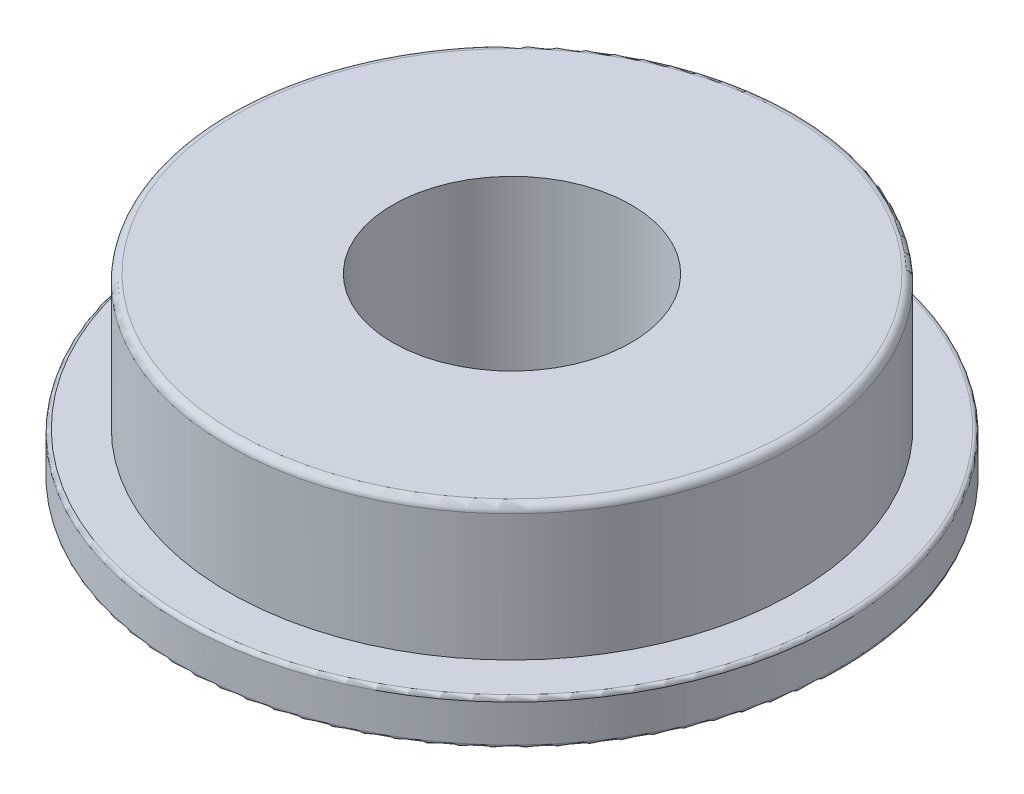
ISO-10303-21;
HEADER;
FILE_DESCRIPTION(('STEP AP214'),'2;1');
FILE_NAME('part.step','',(''),(''),'','','');
FILE_SCHEMA(('AUTOMOTIVE_DESIGN { 1 0 10303 214 1 1 1 1 }'));
ENDSEC;
DATA;
#1=APPLICATION_CONTEXT('core data for automotive mechanical design processes');
#2=APPLICATION_PROTOCOL_DEFINITION('international standard','automotive_design',2000,#1);
#3=PRODUCT_CONTEXT('',#1,'mechanical');
#4=PRODUCT('Part','Part','',(#3));
#5=PRODUCT_RELATED_PRODUCT_CATEGORY('part','',(#4));
#6=PRODUCT_DEFINITION_FORMATION('','',#4);
#7=PRODUCT_DEFINITION_CONTEXT('part definition',#1,'design');
#8=PRODUCT_DEFINITION('design','',#6,#7);
#9=PRODUCT_DEFINITION_SHAPE('','',#8);
#10=(LENGTH_UNIT() NAMED_UNIT(*) SI_UNIT(.MILLI.,.METRE.));
#11=(NAMED_UNIT(*) PLANE_ANGLE_UNIT() SI_UNIT($,.RADIAN.));
#12=(NAMED_UNIT(*) SI_UNIT($,.STERADIAN.) SOLID_ANGLE_UNIT());
#13=UNCERTAINTY_MEASURE_WITH_UNIT(LENGTH_MEASURE(1.E-05),#10,'distance_accuracy_value','');
#14=(GEOMETRIC_REPRESENTATION_CONTEXT(3) GLOBAL_UNCERTAINTY_ASSIGNED_CONTEXT((#13)) GLOBAL_UNIT_ASSIGNED_CONTEXT((#10,
#11,#12)) REPRESENTATION_CONTEXT('',''));
#15=CARTESIAN_POINT('',(0.,0.,0.));
#16=DIRECTION('',(0.,0.,1.));
#17=DIRECTION('',(1.,0.,0.));
#18=AXIS2_PLACEMENT_3D('',#15,#16,#17);
#19=CARTESIAN_POINT('',(0.,0.,0.));
#20=DIRECTION('',(0.,-1.,0.));
#21=DIRECTION('',(0.,0.,-1.));
#22=AXIS2_PLACEMENT_3D('',#19,#20,#21);
#23=CYLINDRICAL_SURFACE('',#22,9.5);
#24=CARTESIAN_POINT('',(0.,1.5,0.));
#25=DIRECTION('',(0.,-1.,0.));
#26=DIRECTION('',(0.,0.,-1.));
#27=AXIS2_PLACEMENT_3D('',#24,#25,#26);
#28=CIRCLE('',#27,9.5);
#29=CARTESIAN_POINT('',(0.,1.5,-9.5));
#30=VERTEX_POINT('',#29);
#31=EDGE_CURVE('E19',#30,#30,#28,.T.);
#32=ORIENTED_EDGE('',*,*,#31,.F.);
#33=EDGE_LOOP('',(#32));
#34=FACE_BOUND('',#33,.T.);
#35=CARTESIAN_POINT('',(0.,5.746,0.));
#36=DIRECTION('',(0.,1.,0.));
#37=DIRECTION('',(0.,0.,1.));
#38=AXIS2_PLACEMENT_3D('',#35,#36,#37);
#39=CIRCLE('',#38,9.5);
#40=CARTESIAN_POINT('',(0.,5.746,9.5));
#41=VERTEX_POINT('',#40);
#42=EDGE_CURVE('E42',#41,#41,#39,.T.);
#43=ORIENTED_EDGE('',*,*,#42,.F.);
#44=EDGE_LOOP('',(#43));
#45=FACE_BOUND('',#44,.T.);
#46=ADVANCED_FACE('F15',(#34,#45),#23,.T.);
#47=CARTESIAN_POINT('',(9.5,1.5,0.));
#48=DIRECTION('',(0.,1.,0.));
#49=DIRECTION('',(0.,0.,1.));
#50=AXIS2_PLACEMENT_3D('',#47,#48,#49);
#51=PLANE('',#50);
#52=CARTESIAN_POINT('',(0.,1.5,0.));
#53=DIRECTION('',(0.,1.,0.));
#54=DIRECTION('',(0.,0.,1.));
#55=AXIS2_PLACEMENT_3D('',#52,#53,#54);
#56=CIRCLE('',#55,10.922);
#57=CARTESIAN_POINT('',(0.,1.5,10.922));
#58=VERTEX_POINT('',#57);
#59=EDGE_CURVE('E40',#58,#58,#56,.F.);
#60=ORIENTED_EDGE('',*,*,#59,.F.);
#61=EDGE_LOOP('',(#60));
#62=FACE_BOUND('',#61,.T.);
#63=ORIENTED_EDGE('',*,*,#31,.T.);
#64=EDGE_LOOP('',(#63));
#65=FACE_BOUND('',#64,.T.);
#66=ADVANCED_FACE('F78',(#62,#65),#51,.T.);
#67=CARTESIAN_POINT('',(0.,5.746,0.));
#68=DIRECTION('',(0.,1.,0.));
#69=DIRECTION('',(0.,0.,1.));
#70=AXIS2_PLACEMENT_3D('',#67,#68,#69);
#71=TOROIDAL_SURFACE('',#70,9.246,0.254);
#72=CARTESIAN_POINT('',(0.,6.,0.));
#73=DIRECTION('',(0.,1.,0.));
#74=DIRECTION('',(0.,0.,1.));
#75=AXIS2_PLACEMENT_3D('',#72,#73,#74);
#76=CIRCLE('',#75,9.246);
#77=CARTESIAN_POINT('',(0.,6.,9.246));
#78=VERTEX_POINT('',#77);
#79=EDGE_CURVE('E38',#78,#78,#76,.T.);
#80=ORIENTED_EDGE('',*,*,#79,.F.);
#81=EDGE_LOOP('',(#80));
#82=FACE_BOUND('',#81,.T.);
#83=ORIENTED_EDGE('',*,*,#42,.T.);
#84=EDGE_LOOP('',(#83));
#85=FACE_BOUND('',#84,.T.);
#86=ADVANCED_FACE('F70',(#82,#85),#71,.T.);
#87=CARTESIAN_POINT('',(0.,1.373,0.));
#88=DIRECTION('',(0.,1.,0.));
#89=DIRECTION('',(0.,0.,1.));
#90=AXIS2_PLACEMENT_3D('',#87,#88,#89);
#91=TOROIDAL_SURFACE('',#90,10.922,0.127);
#92=ORIENTED_EDGE('',*,*,#59,.T.);
#93=EDGE_LOOP('',(#92));
#94=FACE_BOUND('',#93,.T.);
#95=CARTESIAN_POINT('',(0.,1.373,0.));
#96=DIRECTION('',(0.,-1.,0.));
#97=DIRECTION('',(0.,0.,-1.));
#98=AXIS2_PLACEMENT_3D('',#95,#96,#97);
#99=CIRCLE('',#98,11.049);
#100=CARTESIAN_POINT('',(0.,1.373,-11.049));
#101=VERTEX_POINT('',#100);
#102=EDGE_CURVE('E37',#101,#101,#99,.T.);
#103=ORIENTED_EDGE('',*,*,#102,.F.);
#104=EDGE_LOOP('',(#103));
#105=FACE_BOUND('',#104,.T.);
#106=ADVANCED_FACE('F68',(#94,#105),#91,.T.);
#107=CARTESIAN_POINT('',(4.,6.,0.));
#108=DIRECTION('',(0.,1.,0.));
#109=DIRECTION('',(0.,0.,1.));
#110=AXIS2_PLACEMENT_3D('',#107,#108,#109);
#111=PLANE('',#110);
#112=ORIENTED_EDGE('',*,*,#79,.T.);
#113=EDGE_LOOP('',(#112));
#114=FACE_BOUND('',#113,.T.);
#115=CARTESIAN_POINT('',(0.,6.,0.));
#116=DIRECTION('',(0.,-1.,0.));
#117=DIRECTION('',(0.,0.,-1.));
#118=AXIS2_PLACEMENT_3D('',#115,#116,#117);
#119=CIRCLE('',#118,4.);
#120=CARTESIAN_POINT('',(0.,6.,-4.));
#121=VERTEX_POINT('',#120);
#122=EDGE_CURVE('E34',#121,#121,#119,.T.);
#123=ORIENTED_EDGE('',*,*,#122,.T.);
#124=EDGE_LOOP('',(#123));
#125=FACE_BOUND('',#124,.T.);
#126=ADVANCED_FACE('F64',(#114,#125),#111,.T.);
#127=CARTESIAN_POINT('',(0.,0.,0.));
#128=DIRECTION('',(0.,-1.,0.));
#129=DIRECTION('',(0.,0.,-1.));
#130=AXIS2_PLACEMENT_3D('',#127,#128,#129);
#131=CYLINDRICAL_SURFACE('',#130,11.049);
#132=CARTESIAN_POINT('',(0.,0.127,0.));
#133=DIRECTION('',(0.,-1.,0.));
#134=DIRECTION('',(1.,0.,0.));
#135=AXIS2_PLACEMENT_3D('',#132,#133,#134);
#136=CIRCLE('',#135,11.049);
#137=CARTESIAN_POINT('',(11.049,0.127,0.));
#138=VERTEX_POINT('',#137);
#139=EDGE_CURVE('E28',#138,#138,#136,.T.);
#140=ORIENTED_EDGE('',*,*,#139,.F.);
#141=EDGE_LOOP('',(#140));
#142=FACE_BOUND('',#141,.T.);
#143=ORIENTED_EDGE('',*,*,#102,.T.);
#144=EDGE_LOOP('',(#143));
#145=FACE_BOUND('',#144,.T.);
#146=ADVANCED_FACE('F60',(#142,#145),#131,.T.);
#147=CARTESIAN_POINT('',(0.,0.,0.));
#148=DIRECTION('',(0.,-1.,0.));
#149=DIRECTION('',(0.,0.,-1.));
#150=AXIS2_PLACEMENT_3D('',#147,#148,#149);
#151=CYLINDRICAL_SURFACE('',#150,4.);
#152=ORIENTED_EDGE('',*,*,#122,.F.);
#153=EDGE_LOOP('',(#152));
#154=FACE_BOUND('',#153,.T.);
#155=CARTESIAN_POINT('',(0.,0.,0.));
#156=DIRECTION('',(0.,-1.,0.));
#157=DIRECTION('',(0.,0.,-1.));
#158=AXIS2_PLACEMENT_3D('',#155,#156,#157);
#159=CIRCLE('',#158,4.);
#160=CARTESIAN_POINT('',(0.,0.,-4.));
#161=VERTEX_POINT('',#160);
#162=EDGE_CURVE('E23',#161,#161,#159,.F.);
#163=ORIENTED_EDGE('',*,*,#162,.F.);
#164=EDGE_LOOP('',(#163));
#165=FACE_BOUND('',#164,.T.);
#166=ADVANCED_FACE('F63',(#154,#165),#151,.F.);
#167=CARTESIAN_POINT('',(0.,0.127,0.));
#168=DIRECTION('',(0.,-1.,0.));
#169=DIRECTION('',(0.,0.,-1.));
#170=AXIS2_PLACEMENT_3D('',#167,#168,#169);
#171=TOROIDAL_SURFACE('',#170,10.922,0.127);
#172=CARTESIAN_POINT('',(0.,0.,0.));
#173=DIRECTION('',(0.,-1.,0.));
#174=DIRECTION('',(0.,0.,-1.));
#175=AXIS2_PLACEMENT_3D('',#172,#173,#174);
#176=CIRCLE('',#175,10.922);
#177=CARTESIAN_POINT('',(0.,0.,-10.922));
#178=VERTEX_POINT('',#177);
#179=EDGE_CURVE('E10',#178,#178,#176,.T.);
#180=ORIENTED_EDGE('',*,*,#179,.F.);
#181=EDGE_LOOP('',(#180));
#182=FACE_BOUND('',#181,.T.);
#183=ORIENTED_EDGE('',*,*,#139,.T.);
#184=EDGE_LOOP('',(#183));
#185=FACE_BOUND('',#184,.T.);
#186=ADVANCED_FACE('F17',(#182,#185),#171,.T.);
#187=CARTESIAN_POINT('',(11.049,0.,0.));
#188=DIRECTION('',(0.,-1.,0.));
#189=DIRECTION('',(0.,0.,-1.));
#190=AXIS2_PLACEMENT_3D('',#187,#188,#189);
#191=PLANE('',#190);
#192=ORIENTED_EDGE('',*,*,#179,.T.);
#193=EDGE_LOOP('',(#192));
#194=FACE_BOUND('',#193,.T.);
#195=ORIENTED_EDGE('',*,*,#162,.T.);
#196=EDGE_LOOP('',(#195));
#197=FACE_BOUND('',#196,.T.);
#198=ADVANCED_FACE('F81',(#194,#197),#191,.T.);
#199=CLOSED_SHELL('',(#46,#66,#86,#106,#126,#146,#166,#186,#198));
#200=MANIFOLD_SOLID_BREP('B1',#199);
#201=ADVANCED_BREP_SHAPE_REPRESENTATION('',(#18,#200),#14);
#202=SHAPE_DEFINITION_REPRESENTATION(#9,#201);
ENDSEC;
END-ISO-10303-21;
